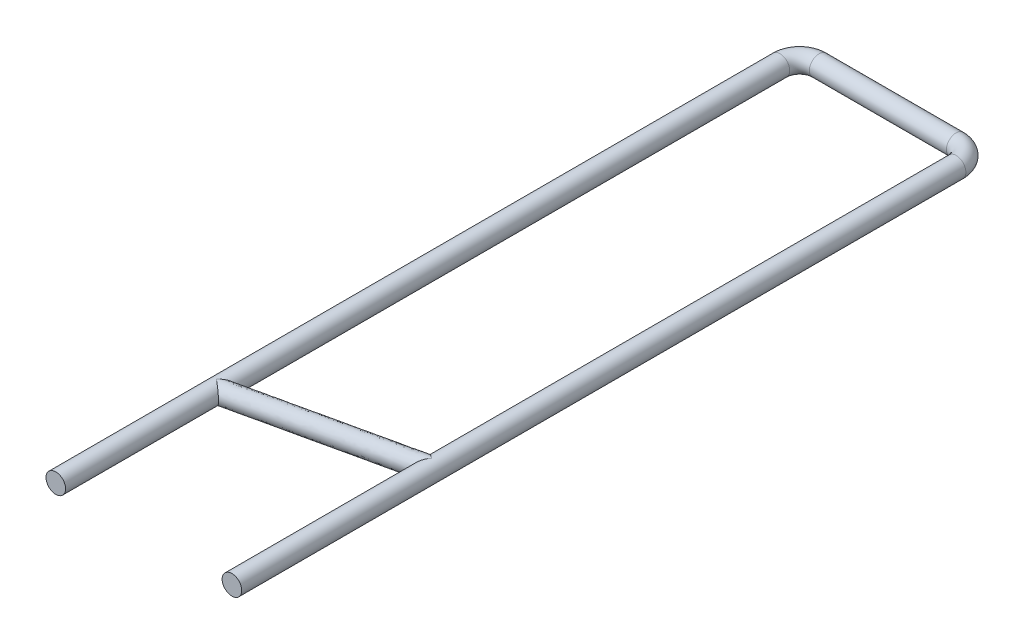
ISO-10303-21;
HEADER;
FILE_DESCRIPTION(('STEP AP214'),'2;1');
FILE_NAME('part.step','',(''),(''),'','','');
FILE_SCHEMA(('AUTOMOTIVE_DESIGN { 1 0 10303 214 1 1 1 1 }'));
ENDSEC;
DATA;
#1=APPLICATION_CONTEXT('core data for automotive mechanical design processes');
#2=APPLICATION_PROTOCOL_DEFINITION('international standard','automotive_design',2000,#1);
#3=PRODUCT_CONTEXT('',#1,'mechanical');
#4=PRODUCT('Part','Part','',(#3));
#5=PRODUCT_RELATED_PRODUCT_CATEGORY('part','',(#4));
#6=PRODUCT_DEFINITION_FORMATION('','',#4);
#7=PRODUCT_DEFINITION_CONTEXT('part definition',#1,'design');
#8=PRODUCT_DEFINITION('design','',#6,#7);
#9=PRODUCT_DEFINITION_SHAPE('','',#8);
#10=(LENGTH_UNIT() NAMED_UNIT(*) SI_UNIT(.MILLI.,.METRE.));
#11=(NAMED_UNIT(*) PLANE_ANGLE_UNIT() SI_UNIT($,.RADIAN.));
#12=(NAMED_UNIT(*) SI_UNIT($,.STERADIAN.) SOLID_ANGLE_UNIT());
#13=UNCERTAINTY_MEASURE_WITH_UNIT(LENGTH_MEASURE(1.E-05),#10,'distance_accuracy_value','');
#14=(GEOMETRIC_REPRESENTATION_CONTEXT(3) GLOBAL_UNCERTAINTY_ASSIGNED_CONTEXT((#13)) GLOBAL_UNIT_ASSIGNED_CONTEXT((#10,
#11,#12)) REPRESENTATION_CONTEXT('',''));
#15=CARTESIAN_POINT('',(0.,0.,0.));
#16=DIRECTION('',(0.,0.,1.));
#17=DIRECTION('',(1.,0.,0.));
#18=AXIS2_PLACEMENT_3D('',#15,#16,#17);
#19=CARTESIAN_POINT('',(-4.5,0.,38.));
#20=DIRECTION('',(0.,0.,1.));
#21=DIRECTION('',(1.,0.,0.));
#22=AXIS2_PLACEMENT_3D('',#19,#20,#21);
#23=PLANE('',#22);
#24=CARTESIAN_POINT('',(-4.5,0.,38.));
#25=DIRECTION('',(0.,0.,1.));
#26=DIRECTION('',(1.,0.,0.));
#27=AXIS2_PLACEMENT_3D('',#24,#25,#26);
#28=CIRCLE('',#27,0.5);
#29=CARTESIAN_POINT('',(-4.,0.,38.));
#30=VERTEX_POINT('',#29);
#31=EDGE_CURVE('E228',#30,#30,#28,.T.);
#32=ORIENTED_EDGE('',*,*,#31,.T.);
#33=EDGE_LOOP('',(#32));
#34=FACE_BOUND('',#33,.T.);
#35=ADVANCED_FACE('F41',(#34),#23,.T.);
#36=CARTESIAN_POINT('',(4.5,0.,38.));
#37=DIRECTION('',(0.,0.,-1.));
#38=DIRECTION('',(-1.,0.,0.));
#39=AXIS2_PLACEMENT_3D('',#36,#37,#38);
#40=PLANE('',#39);
#41=CARTESIAN_POINT('',(4.5,0.,38.));
#42=DIRECTION('',(0.,0.,-1.));
#43=DIRECTION('',(-1.,0.,0.));
#44=AXIS2_PLACEMENT_3D('',#41,#42,#43);
#45=CIRCLE('',#44,0.5);
#46=CARTESIAN_POINT('',(4.,0.,38.));
#47=VERTEX_POINT('',#46);
#48=EDGE_CURVE('E89',#47,#47,#45,.T.);
#49=ORIENTED_EDGE('',*,*,#48,.F.);
#50=EDGE_LOOP('',(#49));
#51=FACE_BOUND('',#50,.T.);
#52=ADVANCED_FACE('F122',(#51),#40,.F.);
#53=CARTESIAN_POINT('',(-4.5,0.,38.));
#54=DIRECTION('',(0.,0.,-1.));
#55=DIRECTION('',(-1.,0.,0.));
#56=AXIS2_PLACEMENT_3D('',#53,#54,#55);
#57=CYLINDRICAL_SURFACE('',#56,0.5);
#58=CARTESIAN_POINT('',(-4.5,-0.499999999999999,29.8));
#59=CARTESIAN_POINT('',(-4.4990443580935,-0.499999984177655,29.7988319932254));
#60=CARTESIAN_POINT('',(-4.49808865493163,-0.499997245049057,29.7976639115832));
#61=CARTESIAN_POINT('',(-4.45406985345318,-0.499745528392892,29.7438631542217));
#62=CARTESIAN_POINT('',(-4.41090040419899,-0.49396472926894,29.6911004940272));
#63=CARTESIAN_POINT('',(-4.34714615207077,-0.476572608731286,29.6131786303056));
#64=CARTESIAN_POINT('',(-4.32603544244294,-0.469307083228244,29.5873766518657));
#65=CARTESIAN_POINT('',(-4.28434263176863,-0.451667810792681,29.5364187721534));
#66=CARTESIAN_POINT('',(-4.26376013494194,-0.441296469473261,29.5112623871496));
#67=CARTESIAN_POINT('',(-4.22151854246437,-0.416063951680496,29.4596337741249));
#68=CARTESIAN_POINT('',(-4.19993681184079,-0.400875415926651,29.4332561033584));
#69=CARTESIAN_POINT('',(-4.15828492855817,-0.366014842494568,29.3823482460181));
#70=CARTESIAN_POINT('',(-4.13821202792759,-0.346351231892074,29.3578147008122));
#71=CARTESIAN_POINT('',(-4.10503527954023,-0.307388884285338,29.3172653416513));
#72=CARTESIAN_POINT('',(-4.09142589544822,-0.289171328530661,29.3006316499623));
#73=CARTESIAN_POINT('',(-4.06613000417653,-0.249612432358642,29.2697144495227));
#74=CARTESIAN_POINT('',(-4.05444200436991,-0.228273541338787,29.2554291164502));
#75=CARTESIAN_POINT('',(-4.03650634106538,-0.188461587565862,29.2335077501925));
#76=CARTESIAN_POINT('',(-4.02963489513299,-0.170693507221388,29.2251093162643));
#77=CARTESIAN_POINT('',(-4.01780692265429,-0.133663055132622,29.2106529054548));
#78=CARTESIAN_POINT('',(-4.01284532128025,-0.114404809103238,29.2045887260062));
#79=CARTESIAN_POINT('',(-4.00517312642826,-0.0745720548899714,29.1952115989709));
#80=CARTESIAN_POINT('',(-4.00248499428047,-0.0539865269283609,29.191926104121));
#81=CARTESIAN_POINT('',(-3.99971995829006,-0.0123839838009958,29.1885466156874));
#82=CARTESIAN_POINT('',(-3.99964120902387,0.00863271590256807,29.1884503665859));
#83=CARTESIAN_POINT('',(-4.0019335338481,0.0475291599781444,29.1912520969244));
#84=CARTESIAN_POINT('',(-4.00398447617417,0.065458634176317,29.1937588042087));
#85=CARTESIAN_POINT('',(-4.00989360650727,0.100564151273058,29.2009810746157));
#86=CARTESIAN_POINT('',(-4.01375353195888,0.117739452440561,29.2056987612818));
#87=CARTESIAN_POINT('',(-4.02437880951908,0.155821509709687,29.2186852116361));
#88=CARTESIAN_POINT('',(-4.03166204440068,0.176366609943972,29.2275869431569));
#89=CARTESIAN_POINT('',(-4.0482380975698,0.215317265560868,29.247846563696));
#90=CARTESIAN_POINT('',(-4.05753453362496,0.233718876278937,29.2592088744304));
#91=CARTESIAN_POINT('',(-4.08201017079362,0.275882056464508,29.2891235420813));
#92=CARTESIAN_POINT('',(-4.09798716196555,0.298483071144112,29.3086509757357));
#93=CARTESIAN_POINT('',(-4.13195769914812,0.339494272286181,29.350170521181));
#94=CARTESIAN_POINT('',(-4.14995562959318,0.3578950736637,29.372167991725));
#95=CARTESIAN_POINT('',(-4.19725220565813,0.399759886702138,29.4299749180267));
#96=CARTESIAN_POINT('',(-4.22745289237298,0.420679958951632,29.4668868684561));
#97=CARTESIAN_POINT('',(-4.28947514650974,0.454900694616085,29.5426918457339));
#98=CARTESIAN_POINT('',(-4.32129836328816,0.46819342938746,29.5815868884624));
#99=CARTESIAN_POINT('',(-4.40083075143289,0.492552806641481,29.6787931406402));
#100=CARTESIAN_POINT('',(-4.44905243876787,0.499717039459272,29.7377307584968));
#101=CARTESIAN_POINT('',(-4.49808865826037,0.499997241040779,29.7976639156517));
#102=CARTESIAN_POINT('',(-4.49904436135866,0.499999980048022,29.7988319972162));
#103=CARTESIAN_POINT('',(-4.5,0.499999999999999,29.8));
#104=B_SPLINE_CURVE_WITH_KNOTS('',3,(#58,#59,#60,#61,#62,#63,#64,#65,#66,#67,#68,#69,#70,#71,
#72,#73,#74,#75,#76,#77,#78,#79,#80,#81,#82,#83,#84,#85,#86,#87,#88,#89,#90,#91,#92,#93,#94,#95,
#96,#97,#98,#99,#100,#101,#102,#103),.UNSPECIFIED.,.F.,.F.,(4,2,2,2,2,2,2,2,2,2,2,2,2,2,2,2,2,2,
2,2,2,2,4),(0.,0.0045276915130136,0.208529836597881,0.310788724592655,0.412968611817219,
0.524631545936488,0.636085920873493,0.720351252407225,0.80455080988334,0.86678103205577,
0.928844735772748,0.991514679853766,1.05414030117036,1.10854762379147,1.16300730955665,
1.23325448931278,1.30362896814741,1.4046829275363,1.50596052161218,1.66132447978533,
1.81684964810539,2.04461994928054,2.04914764079355),.UNSPECIFIED.);
#105=CARTESIAN_POINT('',(-4.5,0.499999999999999,29.8));
#106=VERTEX_POINT('',#105);
#107=CARTESIAN_POINT('',(-4.5,-0.499999999999999,29.8));
#108=VERTEX_POINT('',#107);
#109=EDGE_CURVE('E218',#106,#108,#104,.F.);
#110=ORIENTED_EDGE('',*,*,#109,.T.);
#111=CARTESIAN_POINT('',(-4.5,-0.499999999999999,29.8));
#112=CARTESIAN_POINT('',(-4.49880890900715,-0.500000029255793,29.8009264041056));
#113=CARTESIAN_POINT('',(-4.49761758735462,-0.499995772115226,29.8018529876132));
#114=CARTESIAN_POINT('',(-4.43298939168485,-0.499532275435316,29.8521193620256));
#115=CARTESIAN_POINT('',(-4.36897690305164,-0.486922567855419,29.9019068531682));
#116=CARTESIAN_POINT('',(-4.28100864509654,-0.450487791166105,29.9703266093757));
#117=CARTESIAN_POINT('',(-4.25421894256007,-0.436506763534957,29.9911630446944));
#118=CARTESIAN_POINT('',(-4.20275347403849,-0.403208107190012,30.0311917424289));
#119=CARTESIAN_POINT('',(-4.17807440117078,-0.383899034697442,30.0503865768643));
#120=CARTESIAN_POINT('',(-4.13665594845158,-0.344419266653786,30.0826009289844));
#121=CARTESIAN_POINT('',(-4.11932663406566,-0.32523893667596,30.0960792846327));
#122=CARTESIAN_POINT('',(-4.08736233375371,-0.28357763363078,30.1209404070968));
#123=CARTESIAN_POINT('',(-4.07272228451405,-0.261103009559437,30.1323271120454));
#124=CARTESIAN_POINT('',(-4.04894501359285,-0.216966272418301,30.1508205449827));
#125=CARTESIAN_POINT('',(-4.03930315193252,-0.195741703736483,30.1583197707283));
#126=CARTESIAN_POINT('',(-4.02295313240136,-0.151586283581941,30.1710364525875));
#127=CARTESIAN_POINT('',(-4.0162384311112,-0.12865937333255,30.1762589980272));
#128=CARTESIAN_POINT('',(-4.00609663899078,-0.0815103198715585,30.1841470585601));
#129=CARTESIAN_POINT('',(-4.00268883305993,-0.0572814383605801,30.1867975742871));
#130=CARTESIAN_POINT('',(-3.99947337149862,-0.00844324777269474,30.1892984888356));
#131=CARTESIAN_POINT('',(-3.99966462173322,0.016165943414637,30.1891497386509));
#132=CARTESIAN_POINT('',(-4.00345655965639,0.0628079811204922,30.1862004536015));
#133=CARTESIAN_POINT('',(-4.00676290059821,0.084880517968416,30.1836288550948));
#134=CARTESIAN_POINT('',(-4.01617415938881,0.128070211160117,30.1763089871461));
#135=CARTESIAN_POINT('',(-4.02228300566123,0.149185980546529,30.1715576622634));
#136=CARTESIAN_POINT('',(-4.03720360528553,0.190571238162454,30.1599527514447));
#137=CARTESIAN_POINT('',(-4.04608973641782,0.210797422383111,30.1530413161241));
#138=CARTESIAN_POINT('',(-4.06609768855039,0.249407792925158,30.1374795755777));
#139=CARTESIAN_POINT('',(-4.07722370655636,0.267788422750811,30.128826006014));
#140=CARTESIAN_POINT('',(-4.11680484517378,0.324778666080376,30.0980406759707));
#141=CARTESIAN_POINT('',(-4.14919431606157,0.359123204848523,30.0728488652811));
#142=CARTESIAN_POINT('',(-4.20545695321091,0.404968171713993,30.0290890363942));
#143=CARTESIAN_POINT('',(-4.22762193241687,0.42012872397077,30.0118496081268));
#144=CARTESIAN_POINT('',(-4.27339537942826,0.446483227698176,29.9762480382289));
#145=CARTESIAN_POINT('',(-4.29700552687869,0.457672456779993,29.9578845902078));
#146=CARTESIAN_POINT('',(-4.37780614365459,0.488614023836852,29.8950396660408));
#147=CARTESIAN_POINT('',(-4.43734186849457,0.499563846952026,29.8487341022801));
#148=CARTESIAN_POINT('',(-4.49761756772891,0.499995764781582,29.8018530028775));
#149=CARTESIAN_POINT('',(-4.49880888927586,0.500000021896538,29.8009264194521));
#150=CARTESIAN_POINT('',(-4.5,0.499999999999999,29.8));
#151=B_SPLINE_CURVE_WITH_KNOTS('',3,(#111,#112,#113,#114,#115,#116,#117,#118,#119,#120,#121,
#122,#123,#124,#125,#126,#127,#128,#129,#130,#131,#132,#133,#134,#135,#136,#137,#138,#139,#140,
#141,#142,#143,#144,#145,#146,#147,#148,#149,#150),.UNSPECIFIED.,.F.,.F.,(4,2,2,2,2,2,2,2,2,2,2,
2,2,2,2,2,2,2,2,4),(0.,0.00452770206811064,0.24558214424242,0.355394541710474,0.465031609348711,
0.552164754618152,0.639132126516375,0.712291573351363,0.785286629168742,0.858704858420717,
0.932100768445738,0.99919058664936,1.06637473700083,1.13553962228152,1.20483533265536,
1.36294141057051,1.45842404617918,1.55401984488638,1.77853890991708,1.78306661198519),.UNSPECIFIED.);
#152=EDGE_CURVE('E64',#108,#106,#151,.T.);
#153=ORIENTED_EDGE('',*,*,#152,.T.);
#154=EDGE_LOOP('',(#110,#153));
#155=FACE_BOUND('',#154,.T.);
#156=CARTESIAN_POINT('',(-4.5,0.,1.00000000000001));
#157=DIRECTION('',(0.,0.,1.));
#158=DIRECTION('',(1.,0.,0.));
#159=AXIS2_PLACEMENT_3D('',#156,#157,#158);
#160=CIRCLE('',#159,0.5);
#161=CARTESIAN_POINT('',(-5.00000000000001,0.,1.00000000000001));
#162=VERTEX_POINT('',#161);
#163=EDGE_CURVE('E231',#162,#162,#160,.T.);
#164=ORIENTED_EDGE('',*,*,#163,.T.);
#165=EDGE_LOOP('',(#164));
#166=FACE_BOUND('',#165,.T.);
#167=ORIENTED_EDGE('',*,*,#31,.F.);
#168=EDGE_LOOP('',(#167));
#169=FACE_BOUND('',#168,.T.);
#170=ADVANCED_FACE('F125',(#155,#166,#169),#57,.T.);
#171=CARTESIAN_POINT('',(-3.49999999999999,0.,1.00000000000001));
#172=DIRECTION('',(0.,-1.,0.));
#173=DIRECTION('',(0.,0.,-1.));
#174=AXIS2_PLACEMENT_3D('',#171,#172,#173);
#175=TOROIDAL_SURFACE('',#174,1.00000000000001,0.5);
#176=CARTESIAN_POINT('',(-3.5,0.,0.));
#177=DIRECTION('',(-1.,0.,0.));
#178=DIRECTION('',(0.,0.,1.));
#179=AXIS2_PLACEMENT_3D('',#176,#177,#178);
#180=CIRCLE('',#179,0.5);
#181=CARTESIAN_POINT('',(-3.5,0.,-0.500000000000008));
#182=VERTEX_POINT('',#181);
#183=EDGE_CURVE('E109',#182,#182,#180,.T.);
#184=CARTESIAN_POINT('',(-3.49999999999999,0.,1.00000000000001));
#185=DIRECTION('',(0.,-1.,0.));
#186=DIRECTION('',(0.,0.,-1.));
#187=AXIS2_PLACEMENT_3D('',#184,#185,#186);
#188=CIRCLE('',#187,1.50000000000001);
#189=EDGE_CURVE('',#162,#182,#188,.T.);
#190=ORIENTED_EDGE('',*,*,#163,.F.);
#191=ORIENTED_EDGE('',*,*,#183,.T.);
#192=ORIENTED_EDGE('',*,*,#189,.T.);
#193=ORIENTED_EDGE('',*,*,#189,.F.);
#194=EDGE_LOOP('',(#190,#192,#191,#193));
#195=FACE_BOUND('',#194,.T.);
#196=ADVANCED_FACE('F131',(#195),#175,.T.);
#197=CARTESIAN_POINT('',(-3.5,0.,0.));
#198=DIRECTION('',(1.,0.,0.));
#199=DIRECTION('',(0.,0.,-1.));
#200=AXIS2_PLACEMENT_3D('',#197,#198,#199);
#201=CYLINDRICAL_SURFACE('',#200,0.5);
#202=CARTESIAN_POINT('',(3.49999999999999,0.,0.));
#203=DIRECTION('',(-1.,0.,0.));
#204=DIRECTION('',(0.,0.,1.));
#205=AXIS2_PLACEMENT_3D('',#202,#203,#204);
#206=CIRCLE('',#205,0.5);
#207=CARTESIAN_POINT('',(3.49999999999999,0.,-0.500000000000002));
#208=VERTEX_POINT('',#207);
#209=EDGE_CURVE('E101',#208,#208,#206,.T.);
#210=ORIENTED_EDGE('',*,*,#209,.T.);
#211=EDGE_LOOP('',(#210));
#212=FACE_BOUND('',#211,.T.);
#213=ORIENTED_EDGE('',*,*,#183,.F.);
#214=EDGE_LOOP('',(#213));
#215=FACE_BOUND('',#214,.T.);
#216=ADVANCED_FACE('F150',(#212,#215),#201,.T.);
#217=CARTESIAN_POINT('',(3.49999999999999,0.,1.00000000000001));
#218=DIRECTION('',(0.,-1.,0.));
#219=DIRECTION('',(0.,0.,-1.));
#220=AXIS2_PLACEMENT_3D('',#217,#218,#219);
#221=TOROIDAL_SURFACE('',#220,1.00000000000001,0.5);
#222=CARTESIAN_POINT('',(4.5,0.,1.00000000000001));
#223=DIRECTION('',(0.,0.,-1.));
#224=DIRECTION('',(-1.,0.,0.));
#225=AXIS2_PLACEMENT_3D('',#222,#223,#224);
#226=CIRCLE('',#225,0.5);
#227=CARTESIAN_POINT('',(5.,0.,1.00000000000001));
#228=VERTEX_POINT('',#227);
#229=EDGE_CURVE('E98',#228,#228,#226,.T.);
#230=CARTESIAN_POINT('',(3.49999999999999,0.,1.00000000000001));
#231=DIRECTION('',(0.,-1.,0.));
#232=DIRECTION('',(0.,0.,-1.));
#233=AXIS2_PLACEMENT_3D('',#230,#231,#232);
#234=CIRCLE('',#233,1.50000000000001);
#235=EDGE_CURVE('',#208,#228,#234,.T.);
#236=ORIENTED_EDGE('',*,*,#209,.F.);
#237=ORIENTED_EDGE('',*,*,#229,.T.);
#238=ORIENTED_EDGE('',*,*,#235,.T.);
#239=ORIENTED_EDGE('',*,*,#235,.F.);
#240=EDGE_LOOP('',(#236,#238,#237,#239));
#241=FACE_BOUND('',#240,.T.);
#242=ADVANCED_FACE('F93',(#241),#221,.T.);
#243=CARTESIAN_POINT('',(4.5,0.,1.00000000000001));
#244=DIRECTION('',(0.,0.,1.));
#245=DIRECTION('',(1.,0.,0.));
#246=AXIS2_PLACEMENT_3D('',#243,#244,#245);
#247=CYLINDRICAL_SURFACE('',#246,0.5);
#248=CARTESIAN_POINT('',(4.5,-0.499999999999999,27.8));
#249=CARTESIAN_POINT('',(4.4990443580935,-0.499999984177655,27.8011680067746));
#250=CARTESIAN_POINT('',(4.49808865493163,-0.499997245049057,27.8023360884169));
#251=CARTESIAN_POINT('',(4.45406985345317,-0.499745528392888,27.8561368457783));
#252=CARTESIAN_POINT('',(4.41090040419898,-0.493964729268937,27.9088995059728));
#253=CARTESIAN_POINT('',(4.34714615207076,-0.476572608731283,27.9868213696944));
#254=CARTESIAN_POINT('',(4.32603544244293,-0.469307083228241,28.0126233481343));
#255=CARTESIAN_POINT('',(4.28434263176862,-0.451667810792677,28.0635812278466));
#256=CARTESIAN_POINT('',(4.26376013494193,-0.441296469473255,28.0887376128504));
#257=CARTESIAN_POINT('',(4.22151854246436,-0.416063951680489,28.1403662258751));
#258=CARTESIAN_POINT('',(4.19993681184078,-0.400875415926643,28.1667438966416));
#259=CARTESIAN_POINT('',(4.15828492855816,-0.366014842494558,28.2176517539819));
#260=CARTESIAN_POINT('',(4.13821202792758,-0.346351231892063,28.2421852991878));
#261=CARTESIAN_POINT('',(4.10503527954022,-0.307388884285331,28.2827346583487));
#262=CARTESIAN_POINT('',(4.09142589544821,-0.289171328530657,28.2993683500377));
#263=CARTESIAN_POINT('',(4.06613000417652,-0.249612432358636,28.3302855504774));
#264=CARTESIAN_POINT('',(4.0544420043699,-0.228273541338777,28.3445708835499));
#265=CARTESIAN_POINT('',(4.03650634106537,-0.188461587565847,28.3664922498075));
#266=CARTESIAN_POINT('',(4.02963489513299,-0.170693507221374,28.3748906837357));
#267=CARTESIAN_POINT('',(4.01780692265428,-0.133663055132609,28.3893470945452));
#268=CARTESIAN_POINT('',(4.01284532128025,-0.114404809103225,28.3954112739938));
#269=CARTESIAN_POINT('',(4.00517312642826,-0.0745720548899611,28.4047884010291));
#270=CARTESIAN_POINT('',(4.00248499428047,-0.0539865269283524,28.408073895879));
#271=CARTESIAN_POINT('',(3.99971995829006,-0.0123839838009897,28.4114533843126));
#272=CARTESIAN_POINT('',(3.99964120902387,0.00863271590257352,28.4115496334141));
#273=CARTESIAN_POINT('',(4.0019335338481,0.0475291599781473,28.4087479030756));
#274=CARTESIAN_POINT('',(4.00398447617417,0.0654586341763181,28.4062411957913));
#275=CARTESIAN_POINT('',(4.00989360650728,0.100564151273058,28.3990189253844));
#276=CARTESIAN_POINT('',(4.01375353195888,0.117739452440562,28.3943012387182));
#277=CARTESIAN_POINT('',(4.02437880951908,0.155821509709687,28.3813147883639));
#278=CARTESIAN_POINT('',(4.03166204440068,0.176366609943968,28.3724130568432));
#279=CARTESIAN_POINT('',(4.0482380975698,0.215317265560865,28.352153436304));
#280=CARTESIAN_POINT('',(4.05753453362496,0.233718876278937,28.3407911255696));
#281=CARTESIAN_POINT('',(4.08201017079362,0.275882056464511,28.3108764579187));
#282=CARTESIAN_POINT('',(4.09798716196556,0.298483071144113,28.2913490242643));
#283=CARTESIAN_POINT('',(4.13195769914812,0.339494272286178,28.249829478819));
#284=CARTESIAN_POINT('',(4.14995562959318,0.357895073663695,28.2278320082751));
#285=CARTESIAN_POINT('',(4.19725220565813,0.399759886702134,28.1700250819733));
#286=CARTESIAN_POINT('',(4.22745289237299,0.420679958951632,28.1331131315439));
#287=CARTESIAN_POINT('',(4.28947514650973,0.454900694616087,28.0573081542661));
#288=CARTESIAN_POINT('',(4.32129836328812,0.468193429387459,28.0184131115376));
#289=CARTESIAN_POINT('',(4.40083075143292,0.492552806641477,27.9212068593599));
#290=CARTESIAN_POINT('',(4.44905243876807,0.499717039459268,27.8622692415033));
#291=CARTESIAN_POINT('',(4.49808865826038,0.499997241040779,27.8023360843483));
#292=CARTESIAN_POINT('',(4.49904436135867,0.499999980048022,27.8011680027838));
#293=CARTESIAN_POINT('',(4.5,0.499999999999999,27.8));
#294=B_SPLINE_CURVE_WITH_KNOTS('',3,(#248,#249,#250,#251,#252,#253,#254,#255,#256,#257,#258,
#259,#260,#261,#262,#263,#264,#265,#266,#267,#268,#269,#270,#271,#272,#273,#274,#275,#276,#277,
#278,#279,#280,#281,#282,#283,#284,#285,#286,#287,#288,#289,#290,#291,#292,#293),.UNSPECIFIED.,
.F.,.F.,(4,2,2,2,2,2,2,2,2,2,2,2,2,2,2,2,2,2,2,2,2,2,4),(0.,0.00452769151302281,
0.20852983659789,0.310788724592669,0.412968611817234,0.524631545936499,0.636085920873498,
0.720351252407234,0.804550809883354,0.866781032055782,0.928844735772755,0.991514679853771,
1.05414030117036,1.10854762379147,1.16300730955665,1.23325448931278,1.30362896814741,
1.4046829275363,1.50596052161217,1.66132447978532,1.81684964810538,2.04461994928053,
2.04914764079355),.UNSPECIFIED.);
#295=CARTESIAN_POINT('',(4.5,0.499999999999999,27.8));
#296=VERTEX_POINT('',#295);
#297=CARTESIAN_POINT('',(4.5,-0.499999999999999,27.8));
#298=VERTEX_POINT('',#297);
#299=EDGE_CURVE('E54',#296,#298,#294,.F.);
#300=ORIENTED_EDGE('',*,*,#299,.T.);
#301=CARTESIAN_POINT('',(4.5,-0.499999999999999,27.8));
#302=CARTESIAN_POINT('',(4.49880890900715,-0.500000029255793,27.7990735958944));
#303=CARTESIAN_POINT('',(4.49761758735462,-0.499995772115226,27.7981470123868));
#304=CARTESIAN_POINT('',(4.43298939168513,-0.499532275435316,27.747880637974));
#305=CARTESIAN_POINT('',(4.36897690305169,-0.486922567855417,27.6980931468318));
#306=CARTESIAN_POINT('',(4.28100864509651,-0.450487791166101,27.6296733906244));
#307=CARTESIAN_POINT('',(4.25421894256006,-0.436506763534953,27.6088369553055));
#308=CARTESIAN_POINT('',(4.20275347403849,-0.403208107190005,27.5688082575711));
#309=CARTESIAN_POINT('',(4.17807440117077,-0.383899034697431,27.5496134231356));
#310=CARTESIAN_POINT('',(4.13665594845157,-0.344419266653772,27.5173990710156));
#311=CARTESIAN_POINT('',(4.11932663406565,-0.325238936675946,27.5039207153673));
#312=CARTESIAN_POINT('',(4.0873623337537,-0.283577633630766,27.4790595929032));
#313=CARTESIAN_POINT('',(4.07272228451404,-0.261103009559424,27.4676728879546));
#314=CARTESIAN_POINT('',(4.04894501359284,-0.216966272418286,27.4491794550173));
#315=CARTESIAN_POINT('',(4.03930315193251,-0.195741703736466,27.4416802292717));
#316=CARTESIAN_POINT('',(4.02295313240135,-0.151586283581924,27.4289635474125));
#317=CARTESIAN_POINT('',(4.01623843111119,-0.128659373332535,27.4237410019728));
#318=CARTESIAN_POINT('',(4.00609663899078,-0.0815103198715458,27.4158529414399));
#319=CARTESIAN_POINT('',(4.00268883305993,-0.0572814383605674,27.4132024257129));
#320=CARTESIAN_POINT('',(3.99947337149862,-0.00844324777268305,27.4107015111644));
#321=CARTESIAN_POINT('',(3.99966462173321,0.0161659434146477,27.4108502613491));
#322=CARTESIAN_POINT('',(4.00345655965639,0.0628079811205025,27.4137995463985));
#323=CARTESIAN_POINT('',(4.00676290059822,0.0848805179684268,27.4163711449052));
#324=CARTESIAN_POINT('',(4.01617415938881,0.128070211160128,27.4236910128539));
#325=CARTESIAN_POINT('',(4.02228300566124,0.14918598054654,27.4284423377366));
#326=CARTESIAN_POINT('',(4.03720360528553,0.190571238162462,27.4400472485553));
#327=CARTESIAN_POINT('',(4.04608973641782,0.210797422383117,27.4469586838759));
#328=CARTESIAN_POINT('',(4.0660976885504,0.249407792925162,27.4625204244223));
#329=CARTESIAN_POINT('',(4.07722370655636,0.267788422750815,27.471173993986));
#330=CARTESIAN_POINT('',(4.11680484517379,0.324778666080383,27.5019593240293));
#331=CARTESIAN_POINT('',(4.14919431606157,0.359123204848531,27.5271511347189));
#332=CARTESIAN_POINT('',(4.20545695321091,0.404968171714001,27.5709109636058));
#333=CARTESIAN_POINT('',(4.22762193241688,0.420128723970777,27.5881503918732));
#334=CARTESIAN_POINT('',(4.27339537942827,0.446483227698181,27.6237519617711));
#335=CARTESIAN_POINT('',(4.2970055268787,0.457672456779997,27.6421154097922));
#336=CARTESIAN_POINT('',(4.37780614365461,0.488614023836851,27.7049603339592));
#337=CARTESIAN_POINT('',(4.43734186849467,0.499563846952026,27.7512658977198));
#338=CARTESIAN_POINT('',(4.49761756772891,0.499995764781582,27.7981469971226));
#339=CARTESIAN_POINT('',(4.49880888927586,0.500000021896538,27.7990735805479));
#340=CARTESIAN_POINT('',(4.5,0.499999999999999,27.8));
#341=B_SPLINE_CURVE_WITH_KNOTS('',3,(#301,#302,#303,#304,#305,#306,#307,#308,#309,#310,#311,
#312,#313,#314,#315,#316,#317,#318,#319,#320,#321,#322,#323,#324,#325,#326,#327,#328,#329,#330,
#331,#332,#333,#334,#335,#336,#337,#338,#339,#340),.UNSPECIFIED.,.F.,.F.,(4,2,2,2,2,2,2,2,2,2,2,
2,2,2,2,2,2,2,2,4),(0.,0.00452770206811733,0.245582144242436,0.355394541710489,0.46503160934873,
0.552164754618175,0.639132126516398,0.712291573351382,0.785286629168758,0.858704858420731,
0.932100768445749,0.999190586649372,1.06637473700084,1.13553962228153,1.20483533265537,
1.36294141057053,1.4584240461792,1.55401984488641,1.77853890991709,1.7830666119852),.UNSPECIFIED.);
#342=EDGE_CURVE('E11',#298,#296,#341,.T.);
#343=ORIENTED_EDGE('',*,*,#342,.T.);
#344=EDGE_LOOP('',(#300,#343));
#345=FACE_BOUND('',#344,.T.);
#346=ORIENTED_EDGE('',*,*,#48,.T.);
#347=EDGE_LOOP('',(#346));
#348=FACE_BOUND('',#347,.T.);
#349=ORIENTED_EDGE('',*,*,#229,.F.);
#350=EDGE_LOOP('',(#349));
#351=FACE_BOUND('',#350,.T.);
#352=ADVANCED_FACE('F90',(#345,#348,#351),#247,.T.);
#353=CARTESIAN_POINT('',(-4.5,0.,29.3));
#354=CARTESIAN_POINT('',(4.5,0.,27.3));
#355=CARTESIAN_POINT('',(-4.5,0.999999999999998,29.3));
#356=CARTESIAN_POINT('',(4.5,0.999999999999998,27.3));
#357=CARTESIAN_POINT('',(-4.5,0.999999999999998,30.3));
#358=CARTESIAN_POINT('',(4.5,0.999999999999998,28.3));
#359=CARTESIAN_POINT('',(-4.5,0.,30.3));
#360=CARTESIAN_POINT('',(4.5,0.,28.3));
#361=CARTESIAN_POINT('',(-4.5,-0.999999999999998,30.3));
#362=CARTESIAN_POINT('',(4.5,-0.999999999999998,28.3));
#363=CARTESIAN_POINT('',(-4.5,-0.999999999999998,29.3));
#364=CARTESIAN_POINT('',(4.5,-0.999999999999998,27.3));
#365=CARTESIAN_POINT('',(-4.5,0.,29.3));
#366=CARTESIAN_POINT('',(4.5,0.,27.3));
#367=(BOUNDED_SURFACE() B_SPLINE_SURFACE(3,1,((#353,#354),(#355,#356),(#357,#358),(#359,#360),
(#361,#362),(#363,#364),(#365,#366)),.UNSPECIFIED.,.T.,.F.,.F.) B_SPLINE_SURFACE_WITH_KNOTS((4,
3,4),(2,2),(0.,0.5,1.),(0.,1.),
.UNSPECIFIED.) GEOMETRIC_REPRESENTATION_ITEM() RATIONAL_B_SPLINE_SURFACE(((1.,1.),
(0.333333333333333,0.333333333333333),(0.333333333333333,0.333333333333333),(1.,1.),
(0.333333333333333,0.333333333333333),(0.333333333333333,0.333333333333333),(1.,1.))) REPRESENTATION_ITEM('') SURFACE());
#368=ORIENTED_EDGE('',*,*,#342,.F.);
#369=ORIENTED_EDGE('',*,*,#299,.F.);
#370=EDGE_LOOP('',(#368,#369));
#371=FACE_BOUND('',#370,.T.);
#372=ORIENTED_EDGE('',*,*,#152,.F.);
#373=ORIENTED_EDGE('',*,*,#109,.F.);
#374=EDGE_LOOP('',(#372,#373));
#375=FACE_BOUND('',#374,.T.);
#376=ADVANCED_FACE('F86',(#371,#375),#367,.T.);
#377=CLOSED_SHELL('',(#35,#52,#170,#196,#216,#242,#352,#376));
#378=MANIFOLD_SOLID_BREP('B2',#377);
#379=ADVANCED_BREP_SHAPE_REPRESENTATION('',(#18,#378),#14);
#380=SHAPE_DEFINITION_REPRESENTATION(#9,#379);
ENDSEC;
END-ISO-10303-21;
